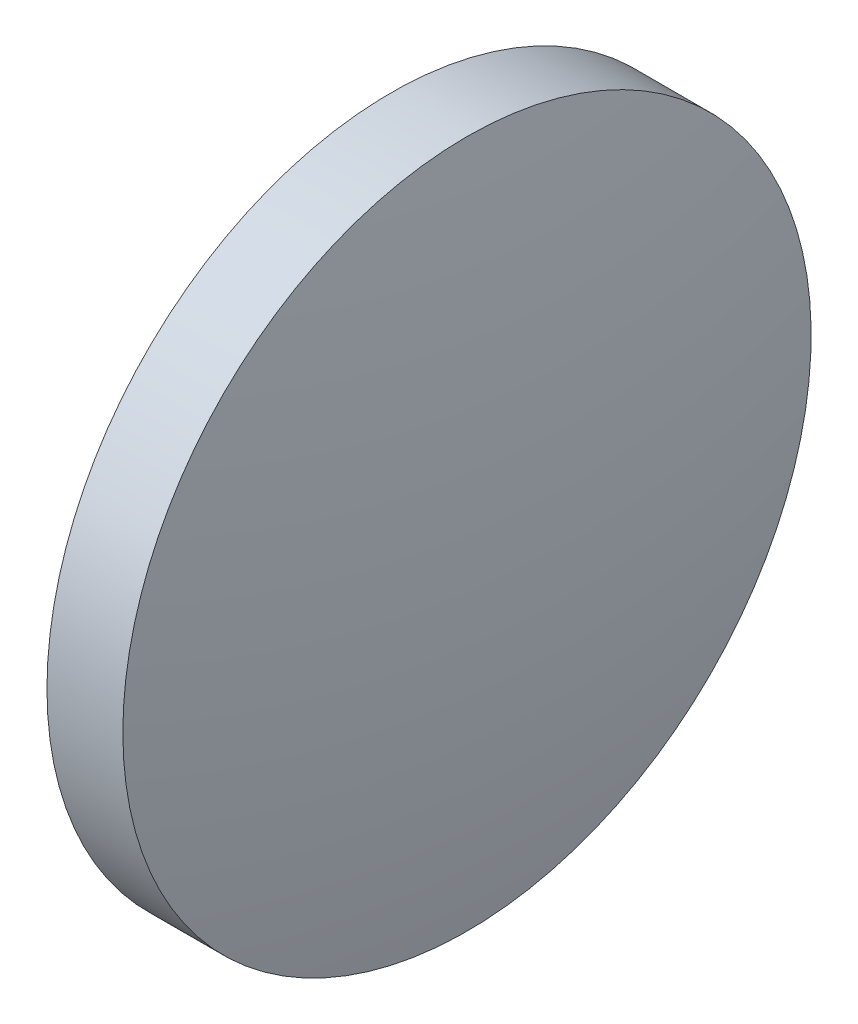
ISO-10303-21;
HEADER;
FILE_DESCRIPTION(('STEP AP214'),'2;1');
FILE_NAME('part.step','',(''),(''),'','','');
FILE_SCHEMA(('AUTOMOTIVE_DESIGN { 1 0 10303 214 1 1 1 1 }'));
ENDSEC;
DATA;
#1=APPLICATION_CONTEXT('core data for automotive mechanical design processes');
#2=APPLICATION_PROTOCOL_DEFINITION('international standard','automotive_design',2000,#1);
#3=PRODUCT_CONTEXT('',#1,'mechanical');
#4=PRODUCT('Part','Part','',(#3));
#5=PRODUCT_RELATED_PRODUCT_CATEGORY('part','',(#4));
#6=PRODUCT_DEFINITION_FORMATION('','',#4);
#7=PRODUCT_DEFINITION_CONTEXT('part definition',#1,'design');
#8=PRODUCT_DEFINITION('design','',#6,#7);
#9=PRODUCT_DEFINITION_SHAPE('','',#8);
#10=(LENGTH_UNIT() NAMED_UNIT(*) SI_UNIT(.MILLI.,.METRE.));
#11=(NAMED_UNIT(*) PLANE_ANGLE_UNIT() SI_UNIT($,.RADIAN.));
#12=(NAMED_UNIT(*) SI_UNIT($,.STERADIAN.) SOLID_ANGLE_UNIT());
#13=UNCERTAINTY_MEASURE_WITH_UNIT(LENGTH_MEASURE(1.E-05),#10,'distance_accuracy_value','');
#14=(GEOMETRIC_REPRESENTATION_CONTEXT(3) GLOBAL_UNCERTAINTY_ASSIGNED_CONTEXT((#13)) GLOBAL_UNIT_ASSIGNED_CONTEXT((#10,
#11,#12)) REPRESENTATION_CONTEXT('',''));
#15=CARTESIAN_POINT('',(0.,0.,0.));
#16=DIRECTION('',(0.,0.,1.));
#17=DIRECTION('',(1.,0.,0.));
#18=AXIS2_PLACEMENT_3D('',#15,#16,#17);
#19=CARTESIAN_POINT('',(163.634776724669,18.7323721779891,0.));
#20=DIRECTION('',(-1.,0.,0.));
#21=DIRECTION('',(0.,1.,0.));
#22=AXIS2_PLACEMENT_3D('',#19,#20,#21);
#23=SPHERICAL_SURFACE('',#22,33.9020833333333);
#24=CARTESIAN_POINT('',(196.936860058002,18.7323721779891,0.));
#25=DIRECTION('',(-1.,0.,0.));
#26=DIRECTION('',(0.,0.,1.));
#27=AXIS2_PLACEMENT_3D('',#24,#25,#26);
#28=CIRCLE('',#27,6.35);
#29=CARTESIAN_POINT('',(196.936860058002,18.7323721779891,6.35));
#30=VERTEX_POINT('',#29);
#31=EDGE_CURVE('E10',#30,#30,#28,.T.);
#32=ORIENTED_EDGE('',*,*,#31,.F.);
#33=EDGE_LOOP('',(#32));
#34=FACE_BOUND('',#33,.T.);
#35=ADVANCED_FACE('F35',(#34),#23,.T.);
#36=CARTESIAN_POINT('',(192.667751040164,18.7323721779891,0.));
#37=DIRECTION('',(-1.,0.,0.));
#38=DIRECTION('',(0.,0.,1.));
#39=AXIS2_PLACEMENT_3D('',#36,#37,#38);
#40=CYLINDRICAL_SURFACE('',#39,6.35);
#41=CARTESIAN_POINT('',(195.536860058002,18.7323721779891,0.));
#42=DIRECTION('',(-1.,0.,0.));
#43=DIRECTION('',(0.,0.,1.));
#44=AXIS2_PLACEMENT_3D('',#41,#42,#43);
#45=CIRCLE('',#44,6.35);
#46=CARTESIAN_POINT('',(195.536860058002,18.7323721779891,6.35));
#47=VERTEX_POINT('',#46);
#48=EDGE_CURVE('E41',#47,#47,#45,.T.);
#49=ORIENTED_EDGE('',*,*,#48,.F.);
#50=EDGE_LOOP('',(#49));
#51=FACE_BOUND('',#50,.T.);
#52=ORIENTED_EDGE('',*,*,#31,.T.);
#53=EDGE_LOOP('',(#52));
#54=FACE_BOUND('',#53,.T.);
#55=ADVANCED_FACE('F49',(#51,#54),#40,.T.);
#56=CARTESIAN_POINT('',(195.536860058002,18.7323721779891,0.));
#57=DIRECTION('',(1.,0.,0.));
#58=DIRECTION('',(0.,0.,-1.));
#59=AXIS2_PLACEMENT_3D('',#56,#57,#58);
#60=PLANE('',#59);
#61=ORIENTED_EDGE('',*,*,#48,.T.);
#62=EDGE_LOOP('',(#61));
#63=FACE_BOUND('',#62,.T.);
#64=ADVANCED_FACE('F47',(#63),#60,.F.);
#65=CLOSED_SHELL('',(#35,#55,#64));
#66=MANIFOLD_SOLID_BREP('B2',#65);
#67=ADVANCED_BREP_SHAPE_REPRESENTATION('',(#18,#66),#14);
#68=SHAPE_DEFINITION_REPRESENTATION(#9,#67);
ENDSEC;
END-ISO-10303-21;
